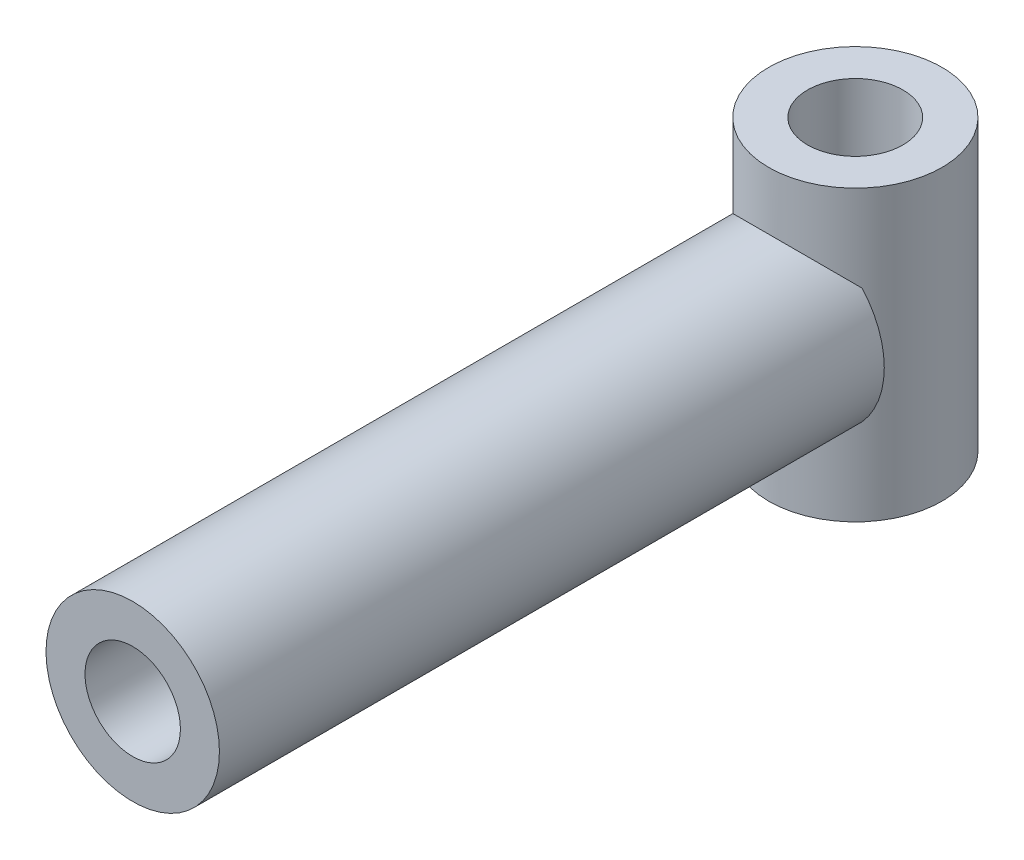
ISO-10303-21;
HEADER;
FILE_DESCRIPTION(('STEP AP214'),'2;1');
FILE_NAME('part.step','',(''),(''),'','','');
FILE_SCHEMA(('AUTOMOTIVE_DESIGN { 1 0 10303 214 1 1 1 1 }'));
ENDSEC;
DATA;
#1=APPLICATION_CONTEXT('core data for automotive mechanical design processes');
#2=APPLICATION_PROTOCOL_DEFINITION('international standard','automotive_design',2000,#1);
#3=PRODUCT_CONTEXT('',#1,'mechanical');
#4=PRODUCT('Part','Part','',(#3));
#5=PRODUCT_RELATED_PRODUCT_CATEGORY('part','',(#4));
#6=PRODUCT_DEFINITION_FORMATION('','',#4);
#7=PRODUCT_DEFINITION_CONTEXT('part definition',#1,'design');
#8=PRODUCT_DEFINITION('design','',#6,#7);
#9=PRODUCT_DEFINITION_SHAPE('','',#8);
#10=(LENGTH_UNIT() NAMED_UNIT(*) SI_UNIT(.MILLI.,.METRE.));
#11=(NAMED_UNIT(*) PLANE_ANGLE_UNIT() SI_UNIT($,.RADIAN.));
#12=(NAMED_UNIT(*) SI_UNIT($,.STERADIAN.) SOLID_ANGLE_UNIT());
#13=UNCERTAINTY_MEASURE_WITH_UNIT(LENGTH_MEASURE(1.E-05),#10,'distance_accuracy_value','');
#14=(GEOMETRIC_REPRESENTATION_CONTEXT(3) GLOBAL_UNCERTAINTY_ASSIGNED_CONTEXT((#13)) GLOBAL_UNIT_ASSIGNED_CONTEXT((#10,
#11,#12)) REPRESENTATION_CONTEXT('',''));
#15=CARTESIAN_POINT('',(0.,0.,0.));
#16=DIRECTION('',(0.,0.,1.));
#17=DIRECTION('',(1.,0.,0.));
#18=AXIS2_PLACEMENT_3D('',#15,#16,#17);
#19=CARTESIAN_POINT('',(0.,0.,23.));
#20=DIRECTION('',(0.,0.,-1.));
#21=DIRECTION('',(-1.,0.,0.));
#22=AXIS2_PLACEMENT_3D('',#19,#20,#21);
#23=CYLINDRICAL_SURFACE('',#22,3.);
#24=CARTESIAN_POINT('',(0.,0.,23.));
#25=DIRECTION('',(0.,0.,1.));
#26=DIRECTION('',(1.,0.,0.));
#27=AXIS2_PLACEMENT_3D('',#24,#25,#26);
#28=CIRCLE('',#27,3.);
#29=CARTESIAN_POINT('',(3.,0.,23.));
#30=VERTEX_POINT('',#29);
#31=EDGE_CURVE('E72',#30,#30,#28,.T.);
#32=ORIENTED_EDGE('',*,*,#31,.F.);
#33=EDGE_LOOP('',(#32));
#34=FACE_BOUND('',#33,.T.);
#35=CARTESIAN_POINT('',(0.,0.,-2.));
#36=DIRECTION('',(0.,-0.707106781186547,-0.707106781186547));
#37=DIRECTION('',(0.,0.707106781186547,-0.707106781186547));
#38=AXIS2_PLACEMENT_3D('',#35,#36,#37);
#39=ELLIPSE('',#38,4.24264068711929,3.);
#40=CARTESIAN_POINT('',(2.23606797749979,-2.,0.));
#41=VERTEX_POINT('',#40);
#42=CARTESIAN_POINT('',(-2.23606797749979,-2.,0.));
#43=VERTEX_POINT('',#42);
#44=EDGE_CURVE('E67',#41,#43,#39,.T.);
#45=ORIENTED_EDGE('',*,*,#44,.F.);
#46=CARTESIAN_POINT('',(0.,0.,0.));
#47=DIRECTION('',(0.,0.,1.));
#48=DIRECTION('',(1.,0.,0.));
#49=AXIS2_PLACEMENT_3D('',#46,#47,#48);
#50=CIRCLE('',#49,3.);
#51=CARTESIAN_POINT('',(2.23606797749979,2.,0.));
#52=VERTEX_POINT('',#51);
#53=EDGE_CURVE('E59',#41,#52,#50,.T.);
#54=ORIENTED_EDGE('',*,*,#53,.T.);
#55=CARTESIAN_POINT('',(0.,0.,-2.));
#56=DIRECTION('',(0.,0.707106781186547,-0.707106781186547));
#57=DIRECTION('',(0.,-0.707106781186547,-0.707106781186547));
#58=AXIS2_PLACEMENT_3D('',#55,#56,#57);
#59=ELLIPSE('',#58,4.24264068711929,3.);
#60=CARTESIAN_POINT('',(-2.23606797749979,2.,0.));
#61=VERTEX_POINT('',#60);
#62=EDGE_CURVE('E52',#61,#52,#59,.T.);
#63=ORIENTED_EDGE('',*,*,#62,.F.);
#64=EDGE_CURVE('E63',#61,#43,#50,.T.);
#65=ORIENTED_EDGE('',*,*,#64,.T.);
#66=EDGE_LOOP('',(#45,#54,#63,#65));
#67=FACE_BOUND('',#66,.T.);
#68=ADVANCED_FACE('F34',(#34,#67),#23,.T.);
#69=CARTESIAN_POINT('',(0.,0.,0.));
#70=DIRECTION('',(0.,0.,1.));
#71=DIRECTION('',(1.,0.,0.));
#72=AXIS2_PLACEMENT_3D('',#69,#70,#71);
#73=PLANE('',#72);
#74=DIRECTION('',(0.,-1.,0.));
#75=VECTOR('',#74,1.);
#76=CARTESIAN_POINT('',(-2.23606797749979,5.,0.));
#77=LINE('',#76,#75);
#78=EDGE_CURVE('E11',#43,#61,#77,.F.);
#79=ORIENTED_EDGE('',*,*,#78,.F.);
#80=ORIENTED_EDGE('',*,*,#64,.F.);
#81=EDGE_LOOP('',(#79,#80));
#82=FACE_BOUND('',#81,.T.);
#83=ADVANCED_FACE('F119',(#82),#73,.F.);
#84=DIRECTION('',(0.,-1.,0.));
#85=VECTOR('',#84,1.);
#86=CARTESIAN_POINT('',(2.23606797749979,5.,0.));
#87=LINE('',#86,#85);
#88=EDGE_CURVE('E41',#52,#41,#87,.T.);
#89=ORIENTED_EDGE('',*,*,#88,.F.);
#90=ORIENTED_EDGE('',*,*,#53,.F.);
#91=EDGE_LOOP('',(#89,#90));
#92=FACE_BOUND('',#91,.T.);
#93=ADVANCED_FACE('F61',(#92),#73,.F.);
#94=CARTESIAN_POINT('',(0.,0.,23.));
#95=DIRECTION('',(0.,0.,1.));
#96=DIRECTION('',(1.,0.,0.));
#97=AXIS2_PLACEMENT_3D('',#94,#95,#96);
#98=PLANE('',#97);
#99=CARTESIAN_POINT('',(0.,0.,23.));
#100=DIRECTION('',(0.,0.,1.));
#101=DIRECTION('',(1.,0.,0.));
#102=AXIS2_PLACEMENT_3D('',#99,#100,#101);
#103=CIRCLE('',#102,1.65);
#104=CARTESIAN_POINT('',(1.65,0.,23.));
#105=VERTEX_POINT('',#104);
#106=EDGE_CURVE('E69',#105,#105,#103,.T.);
#107=ORIENTED_EDGE('',*,*,#106,.F.);
#108=EDGE_LOOP('',(#107));
#109=FACE_BOUND('',#108,.T.);
#110=ORIENTED_EDGE('',*,*,#31,.T.);
#111=EDGE_LOOP('',(#110));
#112=FACE_BOUND('',#111,.T.);
#113=ADVANCED_FACE('F126',(#109,#112),#98,.T.);
#114=CARTESIAN_POINT('',(0.,0.,3.));
#115=DIRECTION('',(0.,0.,1.));
#116=DIRECTION('',(1.,0.,0.));
#117=AXIS2_PLACEMENT_3D('',#114,#115,#116);
#118=CYLINDRICAL_SURFACE('',#117,1.65);
#119=CARTESIAN_POINT('',(0.,0.,3.));
#120=DIRECTION('',(0.,0.,1.));
#121=DIRECTION('',(1.,0.,0.));
#122=AXIS2_PLACEMENT_3D('',#119,#120,#121);
#123=CIRCLE('',#122,1.65);
#124=CARTESIAN_POINT('',(1.65,0.,3.));
#125=VERTEX_POINT('',#124);
#126=EDGE_CURVE('E64',#125,#125,#123,.T.);
#127=ORIENTED_EDGE('',*,*,#126,.F.);
#128=EDGE_LOOP('',(#127));
#129=FACE_BOUND('',#128,.T.);
#130=ORIENTED_EDGE('',*,*,#106,.T.);
#131=EDGE_LOOP('',(#130));
#132=FACE_BOUND('',#131,.T.);
#133=ADVANCED_FACE('F128',(#129,#132),#118,.F.);
#134=CARTESIAN_POINT('',(0.,0.,3.));
#135=DIRECTION('',(0.,0.,1.));
#136=DIRECTION('',(1.,0.,0.));
#137=AXIS2_PLACEMENT_3D('',#134,#135,#136);
#138=PLANE('',#137);
#139=ORIENTED_EDGE('',*,*,#126,.T.);
#140=EDGE_LOOP('',(#139));
#141=FACE_BOUND('',#140,.T.);
#142=ADVANCED_FACE('F111',(#141),#138,.T.);
#143=CARTESIAN_POINT('',(0.,5.,-2.));
#144=DIRECTION('',(0.,-1.,0.));
#145=DIRECTION('',(0.,0.,-1.));
#146=AXIS2_PLACEMENT_3D('',#143,#144,#145);
#147=CYLINDRICAL_SURFACE('',#146,3.);
#148=CARTESIAN_POINT('',(0.,5.,-2.));
#149=DIRECTION('',(0.,1.,0.));
#150=DIRECTION('',(0.,0.,1.));
#151=AXIS2_PLACEMENT_3D('',#148,#149,#150);
#152=CIRCLE('',#151,3.);
#153=CARTESIAN_POINT('',(0.,5.,1.));
#154=VERTEX_POINT('',#153);
#155=EDGE_CURVE('E81',#154,#154,#152,.T.);
#156=ORIENTED_EDGE('',*,*,#155,.F.);
#157=EDGE_LOOP('',(#156));
#158=FACE_BOUND('',#157,.T.);
#159=CARTESIAN_POINT('',(0.,-5.,-2.));
#160=DIRECTION('',(0.,1.,0.));
#161=DIRECTION('',(0.,0.,1.));
#162=AXIS2_PLACEMENT_3D('',#159,#160,#161);
#163=CIRCLE('',#162,3.);
#164=CARTESIAN_POINT('',(0.,-5.,1.));
#165=VERTEX_POINT('',#164);
#166=EDGE_CURVE('E82',#165,#165,#163,.T.);
#167=ORIENTED_EDGE('',*,*,#166,.T.);
#168=EDGE_LOOP('',(#167));
#169=FACE_BOUND('',#168,.T.);
#170=ORIENTED_EDGE('',*,*,#44,.T.);
#171=ORIENTED_EDGE('',*,*,#78,.T.);
#172=ORIENTED_EDGE('',*,*,#62,.T.);
#173=ORIENTED_EDGE('',*,*,#88,.T.);
#174=EDGE_LOOP('',(#170,#171,#172,#173));
#175=FACE_BOUND('',#174,.T.);
#176=ADVANCED_FACE('F71',(#158,#169,#175),#147,.T.);
#177=CARTESIAN_POINT('',(0.,5.,-2.));
#178=DIRECTION('',(0.,1.,0.));
#179=DIRECTION('',(0.,0.,1.));
#180=AXIS2_PLACEMENT_3D('',#177,#178,#179);
#181=PLANE('',#180);
#182=CARTESIAN_POINT('',(0.,5.,-1.99583966738004));
#183=DIRECTION('',(0.,1.,0.));
#184=DIRECTION('',(0.,0.,1.));
#185=AXIS2_PLACEMENT_3D('',#182,#183,#184);
#186=CIRCLE('',#185,1.65);
#187=CARTESIAN_POINT('',(0.,5.,-0.345839667380039));
#188=VERTEX_POINT('',#187);
#189=EDGE_CURVE('E88',#188,#188,#186,.T.);
#190=ORIENTED_EDGE('',*,*,#189,.F.);
#191=EDGE_LOOP('',(#190));
#192=FACE_BOUND('',#191,.T.);
#193=ORIENTED_EDGE('',*,*,#155,.T.);
#194=EDGE_LOOP('',(#193));
#195=FACE_BOUND('',#194,.T.);
#196=ADVANCED_FACE('F103',(#192,#195),#181,.T.);
#197=CARTESIAN_POINT('',(0.,-5.,-2.));
#198=DIRECTION('',(0.,1.,0.));
#199=DIRECTION('',(0.,0.,1.));
#200=AXIS2_PLACEMENT_3D('',#197,#198,#199);
#201=PLANE('',#200);
#202=CARTESIAN_POINT('',(0.,-5.,-1.99583966738004));
#203=DIRECTION('',(0.,1.,0.));
#204=DIRECTION('',(0.,0.,1.));
#205=AXIS2_PLACEMENT_3D('',#202,#203,#204);
#206=CIRCLE('',#205,1.65);
#207=CARTESIAN_POINT('',(0.,-5.,-0.345839667380039));
#208=VERTEX_POINT('',#207);
#209=EDGE_CURVE('E85',#208,#208,#206,.T.);
#210=ORIENTED_EDGE('',*,*,#209,.T.);
#211=EDGE_LOOP('',(#210));
#212=FACE_BOUND('',#211,.T.);
#213=ORIENTED_EDGE('',*,*,#166,.F.);
#214=EDGE_LOOP('',(#213));
#215=FACE_BOUND('',#214,.T.);
#216=ADVANCED_FACE('F94',(#212,#215),#201,.F.);
#217=CARTESIAN_POINT('',(0.,-5.,-1.99583966738004));
#218=DIRECTION('',(0.,1.,0.));
#219=DIRECTION('',(0.,0.,1.));
#220=AXIS2_PLACEMENT_3D('',#217,#218,#219);
#221=CYLINDRICAL_SURFACE('',#220,1.65);
#222=ORIENTED_EDGE('',*,*,#209,.F.);
#223=EDGE_LOOP('',(#222));
#224=FACE_BOUND('',#223,.T.);
#225=ORIENTED_EDGE('',*,*,#189,.T.);
#226=EDGE_LOOP('',(#225));
#227=FACE_BOUND('',#226,.T.);
#228=ADVANCED_FACE('F97',(#224,#227),#221,.F.);
#229=CLOSED_SHELL('',(#68,#83,#93,#113,#133,#142,#176,#196,#216,#228));
#230=MANIFOLD_SOLID_BREP('B2',#229);
#231=ADVANCED_BREP_SHAPE_REPRESENTATION('',(#18,#230),#14);
#232=SHAPE_DEFINITION_REPRESENTATION(#9,#231);
ENDSEC;
END-ISO-10303-21;
